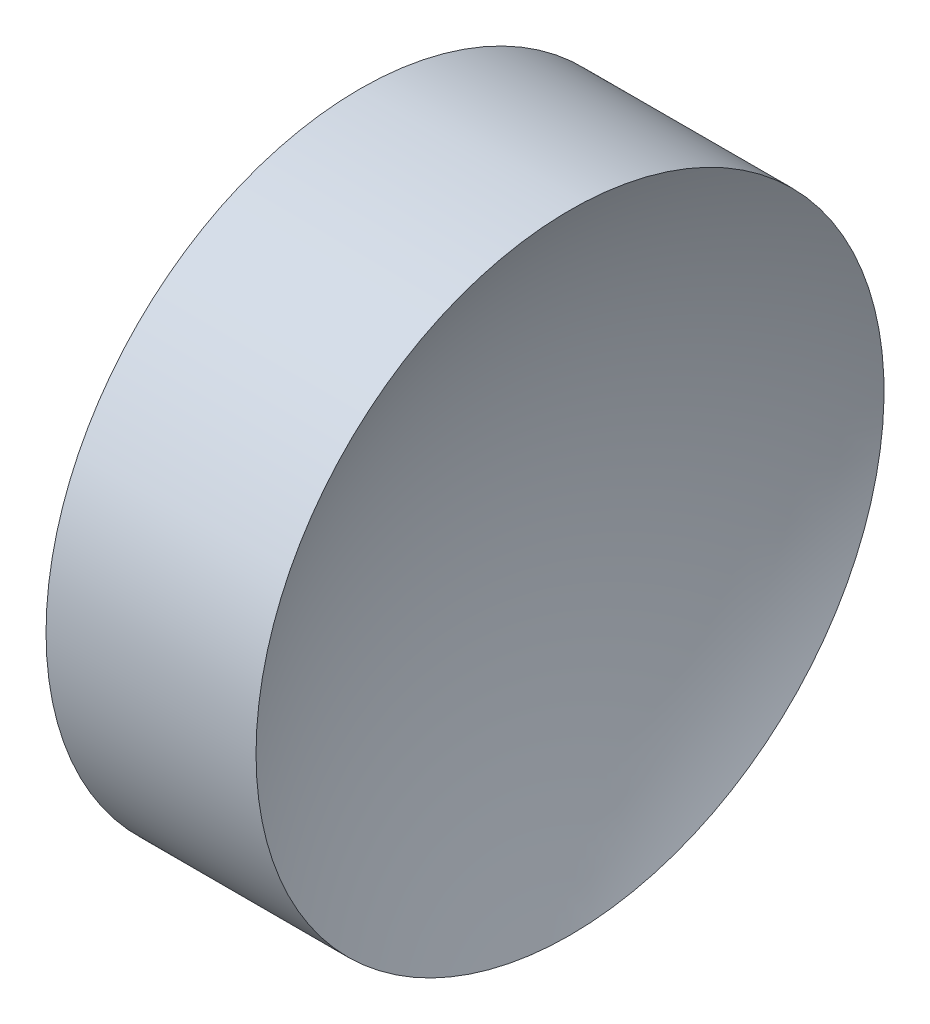
ISO-10303-21;
HEADER;
FILE_DESCRIPTION(('STEP AP214'),'2;1');
FILE_NAME('part.step','',(''),(''),'','','');
FILE_SCHEMA(('AUTOMOTIVE_DESIGN { 1 0 10303 214 1 1 1 1 }'));
ENDSEC;
DATA;
#1=APPLICATION_CONTEXT('core data for automotive mechanical design processes');
#2=APPLICATION_PROTOCOL_DEFINITION('international standard','automotive_design',2000,#1);
#3=PRODUCT_CONTEXT('',#1,'mechanical');
#4=PRODUCT('Part','Part','',(#3));
#5=PRODUCT_RELATED_PRODUCT_CATEGORY('part','',(#4));
#6=PRODUCT_DEFINITION_FORMATION('','',#4);
#7=PRODUCT_DEFINITION_CONTEXT('part definition',#1,'design');
#8=PRODUCT_DEFINITION('design','',#6,#7);
#9=PRODUCT_DEFINITION_SHAPE('','',#8);
#10=(LENGTH_UNIT() NAMED_UNIT(*) SI_UNIT(.MILLI.,.METRE.));
#11=(NAMED_UNIT(*) PLANE_ANGLE_UNIT() SI_UNIT($,.RADIAN.));
#12=(NAMED_UNIT(*) SI_UNIT($,.STERADIAN.) SOLID_ANGLE_UNIT());
#13=UNCERTAINTY_MEASURE_WITH_UNIT(LENGTH_MEASURE(1.E-05),#10,'distance_accuracy_value','');
#14=(GEOMETRIC_REPRESENTATION_CONTEXT(3) GLOBAL_UNCERTAINTY_ASSIGNED_CONTEXT((#13)) GLOBAL_UNIT_ASSIGNED_CONTEXT((#10,
#11,#12)) REPRESENTATION_CONTEXT('',''));
#15=CARTESIAN_POINT('',(0.,0.,0.));
#16=DIRECTION('',(0.,0.,1.));
#17=DIRECTION('',(1.,0.,0.));
#18=AXIS2_PLACEMENT_3D('',#15,#16,#17);
#19=CARTESIAN_POINT('',(87.2124852544419,32.6113014364937,0.));
#20=DIRECTION('',(-1.,0.,0.));
#21=DIRECTION('',(0.,-1.,0.));
#22=AXIS2_PLACEMENT_3D('',#19,#20,#21);
#23=SPHERICAL_SURFACE('',#22,26.16);
#24=CARTESIAN_POINT('',(64.2321545344544,32.6113014364937,0.));
#25=DIRECTION('',(-1.,0.,0.));
#26=DIRECTION('',(0.,0.,1.));
#27=AXIS2_PLACEMENT_3D('',#24,#25,#26);
#28=CIRCLE('',#27,12.5);
#29=CARTESIAN_POINT('',(64.2321545344544,32.6113014364937,12.5));
#30=VERTEX_POINT('',#29);
#31=EDGE_CURVE('E10',#30,#30,#28,.T.);
#32=ORIENTED_EDGE('',*,*,#31,.F.);
#33=EDGE_LOOP('',(#32));
#34=FACE_BOUND('',#33,.T.);
#35=ADVANCED_FACE('F35',(#34),#23,.F.);
#36=CARTESIAN_POINT('',(53.062326392671,32.6113014364937,0.));
#37=DIRECTION('',(-1.,0.,0.));
#38=DIRECTION('',(0.,0.,1.));
#39=AXIS2_PLACEMENT_3D('',#36,#37,#38);
#40=CYLINDRICAL_SURFACE('',#39,12.5);
#41=CARTESIAN_POINT('',(55.8728159744294,32.6113014364937,0.));
#42=DIRECTION('',(-1.,0.,0.));
#43=DIRECTION('',(0.,0.,1.));
#44=AXIS2_PLACEMENT_3D('',#41,#42,#43);
#45=CIRCLE('',#44,12.5);
#46=CARTESIAN_POINT('',(55.8728159744294,32.6113014364937,12.5));
#47=VERTEX_POINT('',#46);
#48=EDGE_CURVE('E41',#47,#47,#45,.T.);
#49=ORIENTED_EDGE('',*,*,#48,.F.);
#50=EDGE_LOOP('',(#49));
#51=FACE_BOUND('',#50,.T.);
#52=ORIENTED_EDGE('',*,*,#31,.T.);
#53=EDGE_LOOP('',(#52));
#54=FACE_BOUND('',#53,.T.);
#55=ADVANCED_FACE('F49',(#51,#54),#40,.T.);
#56=CARTESIAN_POINT('',(32.8924852544419,32.6113014364937,0.));
#57=DIRECTION('',(-1.,0.,0.));
#58=DIRECTION('',(0.,1.,0.));
#59=AXIS2_PLACEMENT_3D('',#56,#57,#58);
#60=SPHERICAL_SURFACE('',#59,26.16);
#61=ORIENTED_EDGE('',*,*,#48,.T.);
#62=EDGE_LOOP('',(#61));
#63=FACE_BOUND('',#62,.T.);
#64=ADVANCED_FACE('F47',(#63),#60,.F.);
#65=CLOSED_SHELL('',(#35,#55,#64));
#66=MANIFOLD_SOLID_BREP('B2',#65);
#67=ADVANCED_BREP_SHAPE_REPRESENTATION('',(#18,#66),#14);
#68=SHAPE_DEFINITION_REPRESENTATION(#9,#67);
ENDSEC;
END-ISO-10303-21;
